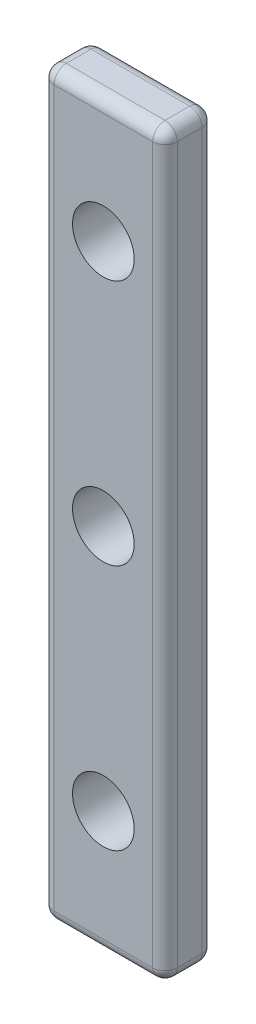
ISO-10303-21;
HEADER;
FILE_DESCRIPTION(('STEP AP214'),'2;1');
FILE_NAME('part.step','',(''),(''),'','','');
FILE_SCHEMA(('AUTOMOTIVE_DESIGN { 1 0 10303 214 1 1 1 1 }'));
ENDSEC;
DATA;
#1=APPLICATION_CONTEXT('core data for automotive mechanical design processes');
#2=APPLICATION_PROTOCOL_DEFINITION('international standard','automotive_design',2000,#1);
#3=PRODUCT_CONTEXT('',#1,'mechanical');
#4=PRODUCT('Part','Part','',(#3));
#5=PRODUCT_RELATED_PRODUCT_CATEGORY('part','',(#4));
#6=PRODUCT_DEFINITION_FORMATION('','',#4);
#7=PRODUCT_DEFINITION_CONTEXT('part definition',#1,'design');
#8=PRODUCT_DEFINITION('design','',#6,#7);
#9=PRODUCT_DEFINITION_SHAPE('','',#8);
#10=(LENGTH_UNIT() NAMED_UNIT(*) SI_UNIT(.MILLI.,.METRE.));
#11=(NAMED_UNIT(*) PLANE_ANGLE_UNIT() SI_UNIT($,.RADIAN.));
#12=(NAMED_UNIT(*) SI_UNIT($,.STERADIAN.) SOLID_ANGLE_UNIT());
#13=UNCERTAINTY_MEASURE_WITH_UNIT(LENGTH_MEASURE(1.E-05),#10,'distance_accuracy_value','');
#14=(GEOMETRIC_REPRESENTATION_CONTEXT(3) GLOBAL_UNCERTAINTY_ASSIGNED_CONTEXT((#13)) GLOBAL_UNIT_ASSIGNED_CONTEXT((#10,
#11,#12)) REPRESENTATION_CONTEXT('',''));
#15=CARTESIAN_POINT('',(0.,0.,0.));
#16=DIRECTION('',(0.,0.,1.));
#17=DIRECTION('',(1.,0.,0.));
#18=AXIS2_PLACEMENT_3D('',#15,#16,#17);
#19=CARTESIAN_POINT('',(0.,0.,4.));
#20=DIRECTION('',(0.,0.,-1.));
#21=DIRECTION('',(-1.,0.,0.));
#22=AXIS2_PLACEMENT_3D('',#19,#20,#21);
#23=PLANE('',#22);
#24=DIRECTION('',(1.,0.,0.));
#25=VECTOR('',#24,1.);
#26=CARTESIAN_POINT('',(0.,1.,4.));
#27=LINE('',#26,#25);
#28=CARTESIAN_POINT('',(1.,1.,4.));
#29=VERTEX_POINT('',#28);
#30=CARTESIAN_POINT('',(9.,1.,4.));
#31=VERTEX_POINT('',#30);
#32=EDGE_CURVE('E49',#29,#31,#27,.T.);
#33=ORIENTED_EDGE('',*,*,#32,.T.);
#34=DIRECTION('',(0.,1.,0.));
#35=VECTOR('',#34,1.);
#36=CARTESIAN_POINT('',(9.,0.,4.));
#37=LINE('',#36,#35);
#38=CARTESIAN_POINT('',(9.,59.,4.));
#39=VERTEX_POINT('',#38);
#40=EDGE_CURVE('E11',#31,#39,#37,.T.);
#41=ORIENTED_EDGE('',*,*,#40,.T.);
#42=DIRECTION('',(-1.,0.,0.));
#43=VECTOR('',#42,1.);
#44=CARTESIAN_POINT('',(0.,59.,4.));
#45=LINE('',#44,#43);
#46=CARTESIAN_POINT('',(1.,59.,4.));
#47=VERTEX_POINT('',#46);
#48=EDGE_CURVE('E208',#39,#47,#45,.T.);
#49=ORIENTED_EDGE('',*,*,#48,.T.);
#50=DIRECTION('',(0.,-1.,0.));
#51=VECTOR('',#50,1.);
#52=CARTESIAN_POINT('',(1.,0.,4.));
#53=LINE('',#52,#51);
#54=EDGE_CURVE('E60',#47,#29,#53,.T.);
#55=ORIENTED_EDGE('',*,*,#54,.T.);
#56=EDGE_LOOP('',(#33,#41,#49,#55));
#57=FACE_BOUND('',#56,.T.);
#58=CARTESIAN_POINT('',(5.,30.,4.));
#59=DIRECTION('',(0.,0.,1.));
#60=DIRECTION('',(1.,0.,0.));
#61=AXIS2_PLACEMENT_3D('',#58,#59,#60);
#62=CIRCLE('',#61,2.5);
#63=CARTESIAN_POINT('',(7.5,30.,4.));
#64=VERTEX_POINT('',#63);
#65=EDGE_CURVE('E165',#64,#64,#62,.T.);
#66=ORIENTED_EDGE('',*,*,#65,.F.);
#67=EDGE_LOOP('',(#66));
#68=FACE_BOUND('',#67,.T.);
#69=CARTESIAN_POINT('',(5.,50.,4.));
#70=DIRECTION('',(0.,0.,1.));
#71=DIRECTION('',(1.,0.,0.));
#72=AXIS2_PLACEMENT_3D('',#69,#70,#71);
#73=CIRCLE('',#72,2.5);
#74=CARTESIAN_POINT('',(7.5,50.,4.));
#75=VERTEX_POINT('',#74);
#76=EDGE_CURVE('E281',#75,#75,#73,.T.);
#77=ORIENTED_EDGE('',*,*,#76,.F.);
#78=EDGE_LOOP('',(#77));
#79=FACE_BOUND('',#78,.T.);
#80=CARTESIAN_POINT('',(5.,10.,4.));
#81=DIRECTION('',(0.,0.,1.));
#82=DIRECTION('',(1.,0.,0.));
#83=AXIS2_PLACEMENT_3D('',#80,#81,#82);
#84=CIRCLE('',#83,2.5);
#85=CARTESIAN_POINT('',(7.5,10.,4.));
#86=VERTEX_POINT('',#85);
#87=EDGE_CURVE('E273',#86,#86,#84,.T.);
#88=ORIENTED_EDGE('',*,*,#87,.F.);
#89=EDGE_LOOP('',(#88));
#90=FACE_BOUND('',#89,.T.);
#91=ADVANCED_FACE('F40',(#57,#68,#79,#90),#23,.F.);
#92=CARTESIAN_POINT('',(0.,0.,0.));
#93=DIRECTION('',(0.,0.,-1.));
#94=DIRECTION('',(-1.,0.,0.));
#95=AXIS2_PLACEMENT_3D('',#92,#93,#94);
#96=PLANE('',#95);
#97=DIRECTION('',(1.,0.,0.));
#98=VECTOR('',#97,1.);
#99=CARTESIAN_POINT('',(0.,1.,0.));
#100=LINE('',#99,#98);
#101=CARTESIAN_POINT('',(9.,1.,0.));
#102=VERTEX_POINT('',#101);
#103=CARTESIAN_POINT('',(1.,1.,0.));
#104=VERTEX_POINT('',#103);
#105=EDGE_CURVE('E201',#102,#104,#100,.F.);
#106=ORIENTED_EDGE('',*,*,#105,.T.);
#107=DIRECTION('',(0.,-1.,0.));
#108=VECTOR('',#107,1.);
#109=CARTESIAN_POINT('',(1.,60.,0.));
#110=LINE('',#109,#108);
#111=CARTESIAN_POINT('',(1.,59.,0.));
#112=VERTEX_POINT('',#111);
#113=EDGE_CURVE('E206',#104,#112,#110,.F.);
#114=ORIENTED_EDGE('',*,*,#113,.T.);
#115=DIRECTION('',(-1.,0.,0.));
#116=VECTOR('',#115,1.);
#117=CARTESIAN_POINT('',(10.,59.,0.));
#118=LINE('',#117,#116);
#119=CARTESIAN_POINT('',(9.,59.,0.));
#120=VERTEX_POINT('',#119);
#121=EDGE_CURVE('E203',#112,#120,#118,.F.);
#122=ORIENTED_EDGE('',*,*,#121,.T.);
#123=DIRECTION('',(0.,1.,0.));
#124=VECTOR('',#123,1.);
#125=CARTESIAN_POINT('',(9.,0.,0.));
#126=LINE('',#125,#124);
#127=EDGE_CURVE('E199',#120,#102,#126,.F.);
#128=ORIENTED_EDGE('',*,*,#127,.T.);
#129=EDGE_LOOP('',(#106,#114,#122,#128));
#130=FACE_BOUND('',#129,.T.);
#131=CARTESIAN_POINT('',(5.,50.,0.));
#132=DIRECTION('',(0.,0.,1.));
#133=DIRECTION('',(1.,0.,0.));
#134=AXIS2_PLACEMENT_3D('',#131,#132,#133);
#135=CIRCLE('',#134,2.5);
#136=CARTESIAN_POINT('',(7.5,50.,0.));
#137=VERTEX_POINT('',#136);
#138=EDGE_CURVE('E278',#137,#137,#135,.T.);
#139=ORIENTED_EDGE('',*,*,#138,.T.);
#140=EDGE_LOOP('',(#139));
#141=FACE_BOUND('',#140,.T.);
#142=CARTESIAN_POINT('',(5.,30.,0.));
#143=DIRECTION('',(0.,0.,1.));
#144=DIRECTION('',(1.,0.,0.));
#145=AXIS2_PLACEMENT_3D('',#142,#143,#144);
#146=CIRCLE('',#145,2.5);
#147=CARTESIAN_POINT('',(7.5,30.,0.));
#148=VERTEX_POINT('',#147);
#149=EDGE_CURVE('E168',#148,#148,#146,.T.);
#150=ORIENTED_EDGE('',*,*,#149,.T.);
#151=EDGE_LOOP('',(#150));
#152=FACE_BOUND('',#151,.T.);
#153=CARTESIAN_POINT('',(5.,10.,0.));
#154=DIRECTION('',(0.,0.,1.));
#155=DIRECTION('',(1.,0.,0.));
#156=AXIS2_PLACEMENT_3D('',#153,#154,#155);
#157=CIRCLE('',#156,2.5);
#158=CARTESIAN_POINT('',(7.5,10.,0.));
#159=VERTEX_POINT('',#158);
#160=EDGE_CURVE('E267',#159,#159,#157,.T.);
#161=ORIENTED_EDGE('',*,*,#160,.T.);
#162=EDGE_LOOP('',(#161));
#163=FACE_BOUND('',#162,.T.);
#164=ADVANCED_FACE('F287',(#130,#141,#152,#163),#96,.T.);
#165=CARTESIAN_POINT('',(0.,0.,4.));
#166=DIRECTION('',(1.,0.,0.));
#167=DIRECTION('',(0.,0.,-1.));
#168=AXIS2_PLACEMENT_3D('',#165,#166,#167);
#169=PLANE('',#168);
#170=DIRECTION('',(0.,0.,-1.));
#171=VECTOR('',#170,1.);
#172=CARTESIAN_POINT('',(0.,59.,4.));
#173=LINE('',#172,#171);
#174=CARTESIAN_POINT('',(0.,59.,3.));
#175=VERTEX_POINT('',#174);
#176=CARTESIAN_POINT('',(0.,59.,1.));
#177=VERTEX_POINT('',#176);
#178=EDGE_CURVE('E176',#175,#177,#173,.T.);
#179=ORIENTED_EDGE('',*,*,#178,.T.);
#180=DIRECTION('',(0.,-1.,0.));
#181=VECTOR('',#180,1.);
#182=CARTESIAN_POINT('',(0.,0.,1.));
#183=LINE('',#182,#181);
#184=CARTESIAN_POINT('',(0.,1.,1.));
#185=VERTEX_POINT('',#184);
#186=EDGE_CURVE('E181',#177,#185,#183,.T.);
#187=ORIENTED_EDGE('',*,*,#186,.T.);
#188=DIRECTION('',(0.,0.,-1.));
#189=VECTOR('',#188,1.);
#190=CARTESIAN_POINT('',(0.,1.,4.));
#191=LINE('',#190,#189);
#192=CARTESIAN_POINT('',(0.,1.,3.));
#193=VERTEX_POINT('',#192);
#194=EDGE_CURVE('E178',#185,#193,#191,.F.);
#195=ORIENTED_EDGE('',*,*,#194,.T.);
#196=DIRECTION('',(0.,-1.,0.));
#197=VECTOR('',#196,1.);
#198=CARTESIAN_POINT('',(0.,0.,3.));
#199=LINE('',#198,#197);
#200=EDGE_CURVE('E174',#193,#175,#199,.F.);
#201=ORIENTED_EDGE('',*,*,#200,.T.);
#202=EDGE_LOOP('',(#179,#187,#195,#201));
#203=FACE_BOUND('',#202,.T.);
#204=ADVANCED_FACE('F310',(#203),#169,.F.);
#205=CARTESIAN_POINT('',(0.,0.,4.));
#206=DIRECTION('',(0.,1.,0.));
#207=DIRECTION('',(0.,0.,1.));
#208=AXIS2_PLACEMENT_3D('',#205,#206,#207);
#209=PLANE('',#208);
#210=DIRECTION('',(0.,0.,-1.));
#211=VECTOR('',#210,1.);
#212=CARTESIAN_POINT('',(1.,0.,4.));
#213=LINE('',#212,#211);
#214=CARTESIAN_POINT('',(1.,0.,3.));
#215=VERTEX_POINT('',#214);
#216=CARTESIAN_POINT('',(1.,0.,1.));
#217=VERTEX_POINT('',#216);
#218=EDGE_CURVE('E139',#215,#217,#213,.T.);
#219=ORIENTED_EDGE('',*,*,#218,.T.);
#220=DIRECTION('',(1.,0.,0.));
#221=VECTOR('',#220,1.);
#222=CARTESIAN_POINT('',(10.,0.,1.));
#223=LINE('',#222,#221);
#224=CARTESIAN_POINT('',(9.,0.,1.));
#225=VERTEX_POINT('',#224);
#226=EDGE_CURVE('E135',#217,#225,#223,.T.);
#227=ORIENTED_EDGE('',*,*,#226,.T.);
#228=DIRECTION('',(0.,0.,-1.));
#229=VECTOR('',#228,1.);
#230=CARTESIAN_POINT('',(9.,0.,4.));
#231=LINE('',#230,#229);
#232=CARTESIAN_POINT('',(9.,0.,3.));
#233=VERTEX_POINT('',#232);
#234=EDGE_CURVE('E127',#225,#233,#231,.F.);
#235=ORIENTED_EDGE('',*,*,#234,.T.);
#236=DIRECTION('',(1.,0.,0.));
#237=VECTOR('',#236,1.);
#238=CARTESIAN_POINT('',(0.,0.,3.));
#239=LINE('',#238,#237);
#240=EDGE_CURVE('E132',#233,#215,#239,.F.);
#241=ORIENTED_EDGE('',*,*,#240,.T.);
#242=EDGE_LOOP('',(#219,#227,#235,#241));
#243=FACE_BOUND('',#242,.T.);
#244=ADVANCED_FACE('F130',(#243),#209,.F.);
#245=CARTESIAN_POINT('',(10.,0.,4.));
#246=DIRECTION('',(-1.,0.,0.));
#247=DIRECTION('',(0.,0.,1.));
#248=AXIS2_PLACEMENT_3D('',#245,#246,#247);
#249=PLANE('',#248);
#250=DIRECTION('',(0.,0.,-1.));
#251=VECTOR('',#250,1.);
#252=CARTESIAN_POINT('',(10.,1.,4.));
#253=LINE('',#252,#251);
#254=CARTESIAN_POINT('',(10.,1.,3.));
#255=VERTEX_POINT('',#254);
#256=CARTESIAN_POINT('',(10.,1.,1.));
#257=VERTEX_POINT('',#256);
#258=EDGE_CURVE('E147',#255,#257,#253,.T.);
#259=ORIENTED_EDGE('',*,*,#258,.T.);
#260=DIRECTION('',(0.,1.,0.));
#261=VECTOR('',#260,1.);
#262=CARTESIAN_POINT('',(10.,60.,1.));
#263=LINE('',#262,#261);
#264=CARTESIAN_POINT('',(10.,59.,1.));
#265=VERTEX_POINT('',#264);
#266=EDGE_CURVE('E188',#257,#265,#263,.T.);
#267=ORIENTED_EDGE('',*,*,#266,.T.);
#268=DIRECTION('',(0.,0.,-1.));
#269=VECTOR('',#268,1.);
#270=CARTESIAN_POINT('',(10.,59.,4.));
#271=LINE('',#270,#269);
#272=CARTESIAN_POINT('',(10.,59.,3.));
#273=VERTEX_POINT('',#272);
#274=EDGE_CURVE('E185',#265,#273,#271,.F.);
#275=ORIENTED_EDGE('',*,*,#274,.T.);
#276=DIRECTION('',(0.,1.,0.));
#277=VECTOR('',#276,1.);
#278=CARTESIAN_POINT('',(10.,0.,3.));
#279=LINE('',#278,#277);
#280=EDGE_CURVE('E183',#273,#255,#279,.F.);
#281=ORIENTED_EDGE('',*,*,#280,.T.);
#282=EDGE_LOOP('',(#259,#267,#275,#281));
#283=FACE_BOUND('',#282,.T.);
#284=ADVANCED_FACE('F317',(#283),#249,.F.);
#285=CARTESIAN_POINT('',(0.,60.,4.));
#286=DIRECTION('',(0.,-1.,0.));
#287=DIRECTION('',(0.,0.,-1.));
#288=AXIS2_PLACEMENT_3D('',#285,#286,#287);
#289=PLANE('',#288);
#290=DIRECTION('',(0.,0.,-1.));
#291=VECTOR('',#290,1.);
#292=CARTESIAN_POINT('',(9.,60.,4.));
#293=LINE('',#292,#291);
#294=CARTESIAN_POINT('',(9.,60.,3.));
#295=VERTEX_POINT('',#294);
#296=CARTESIAN_POINT('',(9.,60.,1.));
#297=VERTEX_POINT('',#296);
#298=EDGE_CURVE('E194',#295,#297,#293,.T.);
#299=ORIENTED_EDGE('',*,*,#298,.T.);
#300=DIRECTION('',(-1.,0.,0.));
#301=VECTOR('',#300,1.);
#302=CARTESIAN_POINT('',(0.,60.,1.));
#303=LINE('',#302,#301);
#304=CARTESIAN_POINT('',(1.,60.,1.));
#305=VERTEX_POINT('',#304);
#306=EDGE_CURVE('E197',#297,#305,#303,.T.);
#307=ORIENTED_EDGE('',*,*,#306,.T.);
#308=DIRECTION('',(0.,0.,-1.));
#309=VECTOR('',#308,1.);
#310=CARTESIAN_POINT('',(1.,60.,4.));
#311=LINE('',#310,#309);
#312=CARTESIAN_POINT('',(1.,60.,3.));
#313=VERTEX_POINT('',#312);
#314=EDGE_CURVE('E192',#305,#313,#311,.F.);
#315=ORIENTED_EDGE('',*,*,#314,.T.);
#316=DIRECTION('',(-1.,0.,0.));
#317=VECTOR('',#316,1.);
#318=CARTESIAN_POINT('',(0.,60.,3.));
#319=LINE('',#318,#317);
#320=EDGE_CURVE('E190',#313,#295,#319,.F.);
#321=ORIENTED_EDGE('',*,*,#320,.T.);
#322=EDGE_LOOP('',(#299,#307,#315,#321));
#323=FACE_BOUND('',#322,.T.);
#324=ADVANCED_FACE('F302',(#323),#289,.F.);
#325=CARTESIAN_POINT('',(5.,30.,4.));
#326=DIRECTION('',(0.,0.,-1.));
#327=DIRECTION('',(-1.,0.,0.));
#328=AXIS2_PLACEMENT_3D('',#325,#326,#327);
#329=CYLINDRICAL_SURFACE('',#328,2.5);
#330=ORIENTED_EDGE('',*,*,#65,.T.);
#331=EDGE_LOOP('',(#330));
#332=FACE_BOUND('',#331,.T.);
#333=ORIENTED_EDGE('',*,*,#149,.F.);
#334=EDGE_LOOP('',(#333));
#335=FACE_BOUND('',#334,.T.);
#336=ADVANCED_FACE('F293',(#332,#335),#329,.F.);
#337=CARTESIAN_POINT('',(5.,50.,4.));
#338=DIRECTION('',(0.,0.,-1.));
#339=DIRECTION('',(-1.,0.,0.));
#340=AXIS2_PLACEMENT_3D('',#337,#338,#339);
#341=CYLINDRICAL_SURFACE('',#340,2.5);
#342=ORIENTED_EDGE('',*,*,#76,.T.);
#343=EDGE_LOOP('',(#342));
#344=FACE_BOUND('',#343,.T.);
#345=ORIENTED_EDGE('',*,*,#138,.F.);
#346=EDGE_LOOP('',(#345));
#347=FACE_BOUND('',#346,.T.);
#348=ADVANCED_FACE('F290',(#344,#347),#341,.F.);
#349=CARTESIAN_POINT('',(5.,10.,4.));
#350=DIRECTION('',(0.,0.,-1.));
#351=DIRECTION('',(-1.,0.,0.));
#352=AXIS2_PLACEMENT_3D('',#349,#350,#351);
#353=CYLINDRICAL_SURFACE('',#352,2.5);
#354=ORIENTED_EDGE('',*,*,#87,.T.);
#355=EDGE_LOOP('',(#354));
#356=FACE_BOUND('',#355,.T.);
#357=ORIENTED_EDGE('',*,*,#160,.F.);
#358=EDGE_LOOP('',(#357));
#359=FACE_BOUND('',#358,.T.);
#360=ADVANCED_FACE('F292',(#356,#359),#353,.F.);
#361=CARTESIAN_POINT('',(9.,59.,4.));
#362=DIRECTION('',(0.,0.,-1.));
#363=DIRECTION('',(-1.,0.,0.));
#364=AXIS2_PLACEMENT_3D('',#361,#362,#363);
#365=CYLINDRICAL_SURFACE('',#364,1.);
#366=CARTESIAN_POINT('',(9.,59.,3.));
#367=DIRECTION('',(0.,0.,1.));
#368=DIRECTION('',(1.,0.,0.));
#369=AXIS2_PLACEMENT_3D('',#366,#367,#368);
#370=CIRCLE('',#369,1.);
#371=EDGE_CURVE('E44',#273,#295,#370,.T.);
#372=ORIENTED_EDGE('',*,*,#371,.F.);
#373=ORIENTED_EDGE('',*,*,#274,.F.);
#374=CARTESIAN_POINT('',(9.,59.,1.));
#375=DIRECTION('',(0.,0.,-1.));
#376=DIRECTION('',(-1.,0.,0.));
#377=AXIS2_PLACEMENT_3D('',#374,#375,#376);
#378=CIRCLE('',#377,1.);
#379=EDGE_CURVE('E260',#297,#265,#378,.T.);
#380=ORIENTED_EDGE('',*,*,#379,.F.);
#381=ORIENTED_EDGE('',*,*,#298,.F.);
#382=EDGE_LOOP('',(#372,#373,#380,#381));
#383=FACE_BOUND('',#382,.T.);
#384=ADVANCED_FACE('F42',(#383),#365,.T.);
#385=CARTESIAN_POINT('',(9.,59.,3.));
#386=DIRECTION('',(0.,0.,1.));
#387=DIRECTION('',(1.,0.,0.));
#388=AXIS2_PLACEMENT_3D('',#385,#386,#387);
#389=SPHERICAL_SURFACE('',#388,1.);
#390=CARTESIAN_POINT('',(9.,59.,3.));
#391=DIRECTION('',(0.,1.,0.));
#392=DIRECTION('',(0.,0.,1.));
#393=AXIS2_PLACEMENT_3D('',#390,#391,#392);
#394=CIRCLE('',#393,1.);
#395=EDGE_CURVE('E255',#273,#39,#394,.F.);
#396=ORIENTED_EDGE('',*,*,#395,.F.);
#397=ORIENTED_EDGE('',*,*,#371,.T.);
#398=CARTESIAN_POINT('',(9.,59.,3.));
#399=DIRECTION('',(1.,0.,0.));
#400=DIRECTION('',(0.,0.,-1.));
#401=AXIS2_PLACEMENT_3D('',#398,#399,#400);
#402=CIRCLE('',#401,1.);
#403=EDGE_CURVE('E258',#39,#295,#402,.F.);
#404=ORIENTED_EDGE('',*,*,#403,.F.);
#405=EDGE_LOOP('',(#396,#397,#404));
#406=FACE_BOUND('',#405,.T.);
#407=ADVANCED_FACE('F391',(#406),#389,.T.);
#408=CARTESIAN_POINT('',(9.,59.,1.));
#409=DIRECTION('',(0.,0.,1.));
#410=DIRECTION('',(1.,0.,0.));
#411=AXIS2_PLACEMENT_3D('',#408,#409,#410);
#412=SPHERICAL_SURFACE('',#411,1.);
#413=CARTESIAN_POINT('',(9.,59.,1.));
#414=DIRECTION('',(1.,0.,0.));
#415=DIRECTION('',(0.,0.,-1.));
#416=AXIS2_PLACEMENT_3D('',#413,#414,#415);
#417=CIRCLE('',#416,1.);
#418=EDGE_CURVE('E249',#297,#120,#417,.F.);
#419=ORIENTED_EDGE('',*,*,#418,.F.);
#420=ORIENTED_EDGE('',*,*,#379,.T.);
#421=CARTESIAN_POINT('',(9.,59.,1.));
#422=DIRECTION('',(0.,1.,0.));
#423=DIRECTION('',(0.,0.,1.));
#424=AXIS2_PLACEMENT_3D('',#421,#422,#423);
#425=CIRCLE('',#424,1.);
#426=EDGE_CURVE('E252',#120,#265,#425,.F.);
#427=ORIENTED_EDGE('',*,*,#426,.F.);
#428=EDGE_LOOP('',(#419,#420,#427));
#429=FACE_BOUND('',#428,.T.);
#430=ADVANCED_FACE('F388',(#429),#412,.T.);
#431=CARTESIAN_POINT('',(0.,59.,3.));
#432=DIRECTION('',(-1.,0.,0.));
#433=DIRECTION('',(0.,0.,1.));
#434=AXIS2_PLACEMENT_3D('',#431,#432,#433);
#435=CYLINDRICAL_SURFACE('',#434,1.);
#436=ORIENTED_EDGE('',*,*,#403,.T.);
#437=ORIENTED_EDGE('',*,*,#320,.F.);
#438=CARTESIAN_POINT('',(1.,59.,3.));
#439=DIRECTION('',(-1.,0.,0.));
#440=DIRECTION('',(0.,0.,1.));
#441=AXIS2_PLACEMENT_3D('',#438,#439,#440);
#442=CIRCLE('',#441,1.);
#443=EDGE_CURVE('E243',#47,#313,#442,.T.);
#444=ORIENTED_EDGE('',*,*,#443,.F.);
#445=ORIENTED_EDGE('',*,*,#48,.F.);
#446=EDGE_LOOP('',(#436,#437,#444,#445));
#447=FACE_BOUND('',#446,.T.);
#448=ADVANCED_FACE('F384',(#447),#435,.T.);
#449=CARTESIAN_POINT('',(9.,0.,3.));
#450=DIRECTION('',(0.,1.,0.));
#451=DIRECTION('',(0.,0.,1.));
#452=AXIS2_PLACEMENT_3D('',#449,#450,#451);
#453=CYLINDRICAL_SURFACE('',#452,1.);
#454=ORIENTED_EDGE('',*,*,#395,.T.);
#455=ORIENTED_EDGE('',*,*,#40,.F.);
#456=CARTESIAN_POINT('',(9.,1.,3.));
#457=DIRECTION('',(0.,-1.,0.));
#458=DIRECTION('',(0.,0.,-1.));
#459=AXIS2_PLACEMENT_3D('',#456,#457,#458);
#460=CIRCLE('',#459,1.);
#461=EDGE_CURVE('E151',#255,#31,#460,.T.);
#462=ORIENTED_EDGE('',*,*,#461,.F.);
#463=ORIENTED_EDGE('',*,*,#280,.F.);
#464=EDGE_LOOP('',(#454,#455,#462,#463));
#465=FACE_BOUND('',#464,.T.);
#466=ADVANCED_FACE('F381',(#465),#453,.T.);
#467=CARTESIAN_POINT('',(9.,1.,4.));
#468=DIRECTION('',(0.,0.,-1.));
#469=DIRECTION('',(-1.,0.,0.));
#470=AXIS2_PLACEMENT_3D('',#467,#468,#469);
#471=CYLINDRICAL_SURFACE('',#470,1.);
#472=CARTESIAN_POINT('',(9.,1.,1.));
#473=DIRECTION('',(0.,0.,-1.));
#474=DIRECTION('',(-1.,0.,0.));
#475=AXIS2_PLACEMENT_3D('',#472,#473,#474);
#476=CIRCLE('',#475,1.);
#477=EDGE_CURVE('E152',#257,#225,#476,.T.);
#478=ORIENTED_EDGE('',*,*,#477,.F.);
#479=ORIENTED_EDGE('',*,*,#258,.F.);
#480=CARTESIAN_POINT('',(9.,1.,3.));
#481=DIRECTION('',(0.,0.,1.));
#482=DIRECTION('',(1.,0.,0.));
#483=AXIS2_PLACEMENT_3D('',#480,#481,#482);
#484=CIRCLE('',#483,1.);
#485=EDGE_CURVE('E143',#233,#255,#484,.T.);
#486=ORIENTED_EDGE('',*,*,#485,.F.);
#487=ORIENTED_EDGE('',*,*,#234,.F.);
#488=EDGE_LOOP('',(#478,#479,#486,#487));
#489=FACE_BOUND('',#488,.T.);
#490=ADVANCED_FACE('F145',(#489),#471,.T.);
#491=CARTESIAN_POINT('',(9.,0.,1.));
#492=DIRECTION('',(0.,-1.,0.));
#493=DIRECTION('',(0.,0.,-1.));
#494=AXIS2_PLACEMENT_3D('',#491,#492,#493);
#495=CYLINDRICAL_SURFACE('',#494,1.);
#496=ORIENTED_EDGE('',*,*,#426,.T.);
#497=ORIENTED_EDGE('',*,*,#266,.F.);
#498=CARTESIAN_POINT('',(9.,1.,1.));
#499=DIRECTION('',(0.,-1.,0.));
#500=DIRECTION('',(0.,0.,-1.));
#501=AXIS2_PLACEMENT_3D('',#498,#499,#500);
#502=CIRCLE('',#501,1.);
#503=EDGE_CURVE('E239',#102,#257,#502,.T.);
#504=ORIENTED_EDGE('',*,*,#503,.F.);
#505=ORIENTED_EDGE('',*,*,#127,.F.);
#506=EDGE_LOOP('',(#496,#497,#504,#505));
#507=FACE_BOUND('',#506,.T.);
#508=ADVANCED_FACE('F374',(#507),#495,.T.);
#509=CARTESIAN_POINT('',(0.,59.,1.));
#510=DIRECTION('',(1.,0.,0.));
#511=DIRECTION('',(0.,0.,-1.));
#512=AXIS2_PLACEMENT_3D('',#509,#510,#511);
#513=CYLINDRICAL_SURFACE('',#512,1.);
#514=ORIENTED_EDGE('',*,*,#418,.T.);
#515=ORIENTED_EDGE('',*,*,#121,.F.);
#516=CARTESIAN_POINT('',(1.,59.,1.));
#517=DIRECTION('',(-1.,0.,0.));
#518=DIRECTION('',(0.,0.,1.));
#519=AXIS2_PLACEMENT_3D('',#516,#517,#518);
#520=CIRCLE('',#519,1.);
#521=EDGE_CURVE('E236',#305,#112,#520,.T.);
#522=ORIENTED_EDGE('',*,*,#521,.F.);
#523=ORIENTED_EDGE('',*,*,#306,.F.);
#524=EDGE_LOOP('',(#514,#515,#522,#523));
#525=FACE_BOUND('',#524,.T.);
#526=ADVANCED_FACE('F370',(#525),#513,.T.);
#527=CARTESIAN_POINT('',(1.,59.,4.));
#528=DIRECTION('',(0.,0.,-1.));
#529=DIRECTION('',(-1.,0.,0.));
#530=AXIS2_PLACEMENT_3D('',#527,#528,#529);
#531=CYLINDRICAL_SURFACE('',#530,1.);
#532=CARTESIAN_POINT('',(1.,59.,3.));
#533=DIRECTION('',(0.,0.,1.));
#534=DIRECTION('',(1.,0.,0.));
#535=AXIS2_PLACEMENT_3D('',#532,#533,#534);
#536=CIRCLE('',#535,1.);
#537=EDGE_CURVE('E246',#313,#175,#536,.T.);
#538=ORIENTED_EDGE('',*,*,#537,.F.);
#539=ORIENTED_EDGE('',*,*,#314,.F.);
#540=CARTESIAN_POINT('',(1.,59.,1.));
#541=DIRECTION('',(0.,0.,-1.));
#542=DIRECTION('',(-1.,0.,0.));
#543=AXIS2_PLACEMENT_3D('',#540,#541,#542);
#544=CIRCLE('',#543,1.);
#545=EDGE_CURVE('E233',#177,#305,#544,.T.);
#546=ORIENTED_EDGE('',*,*,#545,.F.);
#547=ORIENTED_EDGE('',*,*,#178,.F.);
#548=EDGE_LOOP('',(#538,#539,#546,#547));
#549=FACE_BOUND('',#548,.T.);
#550=ADVANCED_FACE('F366',(#549),#531,.T.);
#551=CARTESIAN_POINT('',(1.,59.,3.));
#552=DIRECTION('',(0.,0.,1.));
#553=DIRECTION('',(1.,0.,0.));
#554=AXIS2_PLACEMENT_3D('',#551,#552,#553);
#555=SPHERICAL_SURFACE('',#554,1.);
#556=ORIENTED_EDGE('',*,*,#443,.T.);
#557=ORIENTED_EDGE('',*,*,#537,.T.);
#558=CARTESIAN_POINT('',(1.,59.,3.));
#559=DIRECTION('',(0.,1.,0.));
#560=DIRECTION('',(0.,0.,1.));
#561=AXIS2_PLACEMENT_3D('',#558,#559,#560);
#562=CIRCLE('',#561,1.);
#563=EDGE_CURVE('E158',#47,#175,#562,.F.);
#564=ORIENTED_EDGE('',*,*,#563,.F.);
#565=EDGE_LOOP('',(#556,#557,#564));
#566=FACE_BOUND('',#565,.T.);
#567=ADVANCED_FACE('F363',(#566),#555,.T.);
#568=CARTESIAN_POINT('',(9.,1.,3.));
#569=DIRECTION('',(0.,0.,1.));
#570=DIRECTION('',(1.,0.,0.));
#571=AXIS2_PLACEMENT_3D('',#568,#569,#570);
#572=SPHERICAL_SURFACE('',#571,1.);
#573=ORIENTED_EDGE('',*,*,#485,.T.);
#574=ORIENTED_EDGE('',*,*,#461,.T.);
#575=CARTESIAN_POINT('',(9.,1.,3.));
#576=DIRECTION('',(1.,0.,0.));
#577=DIRECTION('',(0.,0.,-1.));
#578=AXIS2_PLACEMENT_3D('',#575,#576,#577);
#579=CIRCLE('',#578,1.);
#580=EDGE_CURVE('E155',#233,#31,#579,.F.);
#581=ORIENTED_EDGE('',*,*,#580,.F.);
#582=EDGE_LOOP('',(#573,#574,#581));
#583=FACE_BOUND('',#582,.T.);
#584=ADVANCED_FACE('F156',(#583),#572,.T.);
#585=CARTESIAN_POINT('',(9.,1.,1.));
#586=DIRECTION('',(0.,0.,1.));
#587=DIRECTION('',(1.,0.,0.));
#588=AXIS2_PLACEMENT_3D('',#585,#586,#587);
#589=SPHERICAL_SURFACE('',#588,1.);
#590=ORIENTED_EDGE('',*,*,#503,.T.);
#591=ORIENTED_EDGE('',*,*,#477,.T.);
#592=CARTESIAN_POINT('',(9.,1.,1.));
#593=DIRECTION('',(1.,0.,0.));
#594=DIRECTION('',(0.,0.,-1.));
#595=AXIS2_PLACEMENT_3D('',#592,#593,#594);
#596=CIRCLE('',#595,1.);
#597=EDGE_CURVE('E159',#102,#225,#596,.F.);
#598=ORIENTED_EDGE('',*,*,#597,.F.);
#599=EDGE_LOOP('',(#590,#591,#598));
#600=FACE_BOUND('',#599,.T.);
#601=ADVANCED_FACE('F356',(#600),#589,.T.);
#602=CARTESIAN_POINT('',(1.,59.,1.));
#603=DIRECTION('',(0.,0.,1.));
#604=DIRECTION('',(1.,0.,0.));
#605=AXIS2_PLACEMENT_3D('',#602,#603,#604);
#606=SPHERICAL_SURFACE('',#605,1.);
#607=ORIENTED_EDGE('',*,*,#545,.T.);
#608=ORIENTED_EDGE('',*,*,#521,.T.);
#609=CARTESIAN_POINT('',(1.,59.,1.));
#610=DIRECTION('',(0.,1.,0.));
#611=DIRECTION('',(0.,0.,1.));
#612=AXIS2_PLACEMENT_3D('',#609,#610,#611);
#613=CIRCLE('',#612,1.);
#614=EDGE_CURVE('E226',#177,#112,#613,.F.);
#615=ORIENTED_EDGE('',*,*,#614,.F.);
#616=EDGE_LOOP('',(#607,#608,#615));
#617=FACE_BOUND('',#616,.T.);
#618=ADVANCED_FACE('F352',(#617),#606,.T.);
#619=CARTESIAN_POINT('',(1.,0.,3.));
#620=DIRECTION('',(0.,-1.,0.));
#621=DIRECTION('',(0.,0.,-1.));
#622=AXIS2_PLACEMENT_3D('',#619,#620,#621);
#623=CYLINDRICAL_SURFACE('',#622,1.);
#624=ORIENTED_EDGE('',*,*,#563,.T.);
#625=ORIENTED_EDGE('',*,*,#200,.F.);
#626=CARTESIAN_POINT('',(1.,1.,3.));
#627=DIRECTION('',(0.,-1.,0.));
#628=DIRECTION('',(0.,0.,-1.));
#629=AXIS2_PLACEMENT_3D('',#626,#627,#628);
#630=CIRCLE('',#629,1.);
#631=EDGE_CURVE('E223',#29,#193,#630,.T.);
#632=ORIENTED_EDGE('',*,*,#631,.F.);
#633=ORIENTED_EDGE('',*,*,#54,.F.);
#634=EDGE_LOOP('',(#624,#625,#632,#633));
#635=FACE_BOUND('',#634,.T.);
#636=ADVANCED_FACE('F349',(#635),#623,.T.);
#637=CARTESIAN_POINT('',(0.,1.,3.));
#638=DIRECTION('',(1.,0.,0.));
#639=DIRECTION('',(0.,0.,-1.));
#640=AXIS2_PLACEMENT_3D('',#637,#638,#639);
#641=CYLINDRICAL_SURFACE('',#640,1.);
#642=ORIENTED_EDGE('',*,*,#580,.T.);
#643=ORIENTED_EDGE('',*,*,#32,.F.);
#644=CARTESIAN_POINT('',(1.,1.,3.));
#645=DIRECTION('',(-1.,0.,0.));
#646=DIRECTION('',(0.,0.,1.));
#647=AXIS2_PLACEMENT_3D('',#644,#645,#646);
#648=CIRCLE('',#647,1.);
#649=EDGE_CURVE('E163',#215,#29,#648,.T.);
#650=ORIENTED_EDGE('',*,*,#649,.F.);
#651=ORIENTED_EDGE('',*,*,#240,.F.);
#652=EDGE_LOOP('',(#642,#643,#650,#651));
#653=FACE_BOUND('',#652,.T.);
#654=ADVANCED_FACE('F161',(#653),#641,.T.);
#655=CARTESIAN_POINT('',(0.,1.,1.));
#656=DIRECTION('',(-1.,0.,0.));
#657=DIRECTION('',(0.,0.,1.));
#658=AXIS2_PLACEMENT_3D('',#655,#656,#657);
#659=CYLINDRICAL_SURFACE('',#658,1.);
#660=ORIENTED_EDGE('',*,*,#597,.T.);
#661=ORIENTED_EDGE('',*,*,#226,.F.);
#662=CARTESIAN_POINT('',(1.,1.,1.));
#663=DIRECTION('',(-1.,0.,0.));
#664=DIRECTION('',(0.,0.,1.));
#665=AXIS2_PLACEMENT_3D('',#662,#663,#664);
#666=CIRCLE('',#665,1.);
#667=EDGE_CURVE('E219',#104,#217,#666,.T.);
#668=ORIENTED_EDGE('',*,*,#667,.F.);
#669=ORIENTED_EDGE('',*,*,#105,.F.);
#670=EDGE_LOOP('',(#660,#661,#668,#669));
#671=FACE_BOUND('',#670,.T.);
#672=ADVANCED_FACE('F342',(#671),#659,.T.);
#673=CARTESIAN_POINT('',(1.,0.,1.));
#674=DIRECTION('',(0.,1.,0.));
#675=DIRECTION('',(0.,0.,1.));
#676=AXIS2_PLACEMENT_3D('',#673,#674,#675);
#677=CYLINDRICAL_SURFACE('',#676,1.);
#678=ORIENTED_EDGE('',*,*,#614,.T.);
#679=ORIENTED_EDGE('',*,*,#113,.F.);
#680=CARTESIAN_POINT('',(1.,1.,1.));
#681=DIRECTION('',(0.,-1.,0.));
#682=DIRECTION('',(0.,0.,-1.));
#683=AXIS2_PLACEMENT_3D('',#680,#681,#682);
#684=CIRCLE('',#683,1.);
#685=EDGE_CURVE('E216',#185,#104,#684,.T.);
#686=ORIENTED_EDGE('',*,*,#685,.F.);
#687=ORIENTED_EDGE('',*,*,#186,.F.);
#688=EDGE_LOOP('',(#678,#679,#686,#687));
#689=FACE_BOUND('',#688,.T.);
#690=ADVANCED_FACE('F338',(#689),#677,.T.);
#691=CARTESIAN_POINT('',(1.,1.,3.));
#692=DIRECTION('',(0.,0.,1.));
#693=DIRECTION('',(1.,0.,0.));
#694=AXIS2_PLACEMENT_3D('',#691,#692,#693);
#695=SPHERICAL_SURFACE('',#694,1.);
#696=ORIENTED_EDGE('',*,*,#649,.T.);
#697=ORIENTED_EDGE('',*,*,#631,.T.);
#698=CARTESIAN_POINT('',(1.,1.,3.));
#699=DIRECTION('',(0.,0.,1.));
#700=DIRECTION('',(1.,0.,0.));
#701=AXIS2_PLACEMENT_3D('',#698,#699,#700);
#702=CIRCLE('',#701,1.);
#703=EDGE_CURVE('E214',#215,#193,#702,.F.);
#704=ORIENTED_EDGE('',*,*,#703,.F.);
#705=EDGE_LOOP('',(#696,#697,#704));
#706=FACE_BOUND('',#705,.T.);
#707=ADVANCED_FACE('F334',(#706),#695,.T.);
#708=CARTESIAN_POINT('',(1.,1.,1.));
#709=DIRECTION('',(0.,0.,1.));
#710=DIRECTION('',(1.,0.,0.));
#711=AXIS2_PLACEMENT_3D('',#708,#709,#710);
#712=SPHERICAL_SURFACE('',#711,1.);
#713=ORIENTED_EDGE('',*,*,#685,.T.);
#714=ORIENTED_EDGE('',*,*,#667,.T.);
#715=CARTESIAN_POINT('',(1.,1.,1.));
#716=DIRECTION('',(0.,0.,-1.));
#717=DIRECTION('',(-1.,0.,0.));
#718=AXIS2_PLACEMENT_3D('',#715,#716,#717);
#719=CIRCLE('',#718,1.);
#720=EDGE_CURVE('E212',#185,#217,#719,.F.);
#721=ORIENTED_EDGE('',*,*,#720,.F.);
#722=EDGE_LOOP('',(#713,#714,#721));
#723=FACE_BOUND('',#722,.T.);
#724=ADVANCED_FACE('F330',(#723),#712,.T.);
#725=CARTESIAN_POINT('',(1.,1.,4.));
#726=DIRECTION('',(0.,0.,-1.));
#727=DIRECTION('',(-1.,0.,0.));
#728=AXIS2_PLACEMENT_3D('',#725,#726,#727);
#729=CYLINDRICAL_SURFACE('',#728,1.);
#730=ORIENTED_EDGE('',*,*,#703,.T.);
#731=ORIENTED_EDGE('',*,*,#194,.F.);
#732=ORIENTED_EDGE('',*,*,#720,.T.);
#733=ORIENTED_EDGE('',*,*,#218,.F.);
#734=EDGE_LOOP('',(#730,#731,#732,#733));
#735=FACE_BOUND('',#734,.T.);
#736=ADVANCED_FACE('F327',(#735),#729,.T.);
#737=CLOSED_SHELL('',(#91,#164,#204,#244,#284,#324,#336,#348,#360,#384,#407,#430,#448,#466,#490,
#508,#526,#550,#567,#584,#601,#618,#636,#654,#672,#690,#707,#724,#736));
#738=MANIFOLD_SOLID_BREP('B2',#737);
#739=ADVANCED_BREP_SHAPE_REPRESENTATION('',(#18,#738),#14);
#740=SHAPE_DEFINITION_REPRESENTATION(#9,#739);
ENDSEC;
END-ISO-10303-21;
